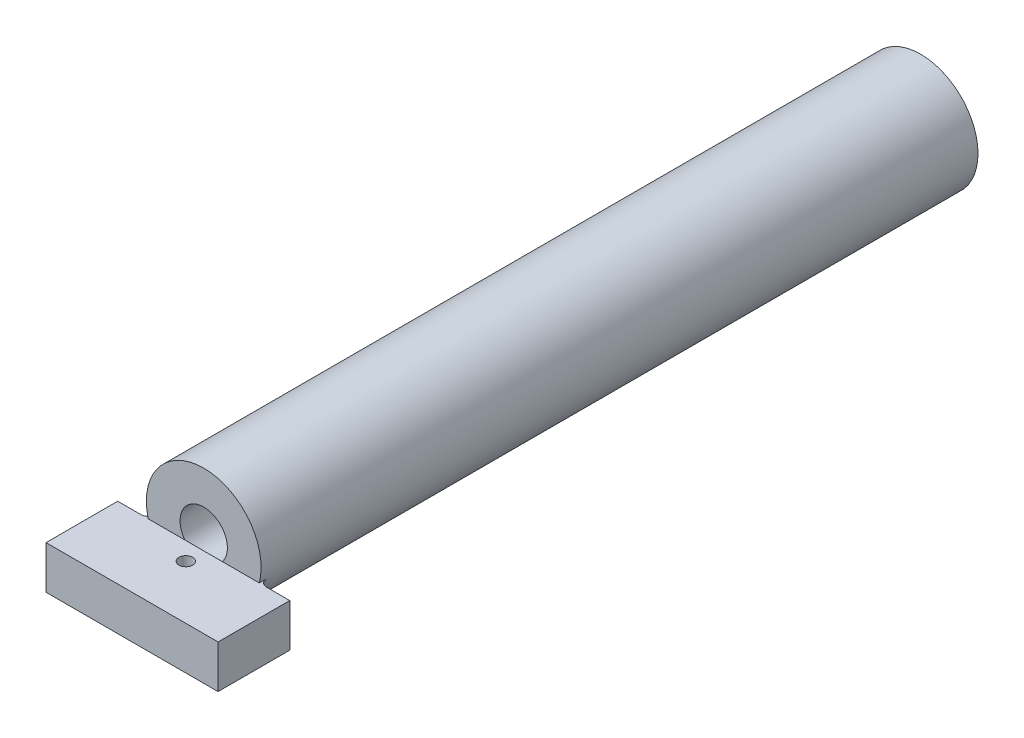
ISO-10303-21;
HEADER;
FILE_DESCRIPTION(('STEP AP214'),'2;1');
FILE_NAME('part.step','',(''),(''),'','','');
FILE_SCHEMA(('AUTOMOTIVE_DESIGN { 1 0 10303 214 1 1 1 1 }'));
ENDSEC;
DATA;
#1=APPLICATION_CONTEXT('core data for automotive mechanical design processes');
#2=APPLICATION_PROTOCOL_DEFINITION('international standard','automotive_design',2000,#1);
#3=PRODUCT_CONTEXT('',#1,'mechanical');
#4=PRODUCT('Part','Part','',(#3));
#5=PRODUCT_RELATED_PRODUCT_CATEGORY('part','',(#4));
#6=PRODUCT_DEFINITION_FORMATION('','',#4);
#7=PRODUCT_DEFINITION_CONTEXT('part definition',#1,'design');
#8=PRODUCT_DEFINITION('design','',#6,#7);
#9=PRODUCT_DEFINITION_SHAPE('','',#8);
#10=(LENGTH_UNIT() NAMED_UNIT(*) SI_UNIT(.MILLI.,.METRE.));
#11=(NAMED_UNIT(*) PLANE_ANGLE_UNIT() SI_UNIT($,.RADIAN.));
#12=(NAMED_UNIT(*) SI_UNIT($,.STERADIAN.) SOLID_ANGLE_UNIT());
#13=UNCERTAINTY_MEASURE_WITH_UNIT(LENGTH_MEASURE(1.E-05),#10,'distance_accuracy_value','');
#14=(GEOMETRIC_REPRESENTATION_CONTEXT(3) GLOBAL_UNCERTAINTY_ASSIGNED_CONTEXT((#13)) GLOBAL_UNIT_ASSIGNED_CONTEXT((#10,
#11,#12)) REPRESENTATION_CONTEXT('',''));
#15=CARTESIAN_POINT('',(0.,0.,0.));
#16=DIRECTION('',(0.,0.,1.));
#17=DIRECTION('',(1.,0.,0.));
#18=AXIS2_PLACEMENT_3D('',#15,#16,#17);
#19=CARTESIAN_POINT('',(-6.,-1.,55.));
#20=DIRECTION('',(0.,-1.,0.));
#21=DIRECTION('',(1.,0.,0.));
#22=AXIS2_PLACEMENT_3D('',#19,#20,#21);
#23=PLANE('',#22);
#24=DIRECTION('',(-1.,0.,0.));
#25=VECTOR('',#24,1.);
#26=CARTESIAN_POINT('',(-6.,-1.,50.));
#27=LINE('',#26,#25);
#28=CARTESIAN_POINT('',(6.,-0.999999999999997,50.));
#29=VERTEX_POINT('',#28);
#30=CARTESIAN_POINT('',(4.38748219369606,-0.999999999999998,50.));
#31=VERTEX_POINT('',#30);
#32=EDGE_CURVE('E162',#29,#31,#27,.T.);
#33=ORIENTED_EDGE('',*,*,#32,.T.);
#34=CARTESIAN_POINT('',(4.38748219369606,-0.999999999999998,50.));
#35=CARTESIAN_POINT('',(4.3579655596069,-0.999999999999998,50.0000208387773));
#36=CARTESIAN_POINT('',(4.32845429997108,-0.999999999999998,49.9975165101157));
#37=CARTESIAN_POINT('',(4.27026566312128,-0.999999999999998,49.9876239291536));
#38=CARTESIAN_POINT('',(4.24158816656995,-0.999999999999998,49.9802363794221));
#39=CARTESIAN_POINT('',(4.18586439432141,-0.999999999999998,49.9607377881979));
#40=CARTESIAN_POINT('',(4.15881911487868,-0.999999999999998,49.948623894897));
#41=CARTESIAN_POINT('',(4.10717852525789,-0.999999999999998,49.9199906414731));
#42=CARTESIAN_POINT('',(4.0825824373352,-0.999999999999998,49.9034726860338));
#43=CARTESIAN_POINT('',(4.03680615359169,-0.999999999999998,49.8666344160125));
#44=CARTESIAN_POINT('',(4.01559576179776,-0.999999999999998,49.846351665449));
#45=CARTESIAN_POINT('',(3.97698904486767,-0.999999999999998,49.8024209202437));
#46=CARTESIAN_POINT('',(3.95959314486626,-0.999999999999998,49.778772550979));
#47=CARTESIAN_POINT('',(3.92961870799203,-0.999999999999998,49.7294523983464));
#48=CARTESIAN_POINT('',(3.91692533752926,-0.999999999999998,49.7038503301077));
#49=CARTESIAN_POINT('',(3.8961734608679,-0.999999999999998,49.6508444296601));
#50=CARTESIAN_POINT('',(3.88811009706772,-0.999999999999998,49.6234425195385));
#51=CARTESIAN_POINT('',(3.87933882799489,-0.999999999999998,49.5798367998571));
#52=CARTESIAN_POINT('',(3.87695695138903,-0.999999999999998,49.563952081624));
#53=CARTESIAN_POINT('',(3.87377975340196,-0.999999999999998,49.5320475816672));
#54=CARTESIAN_POINT('',(3.87298218705146,-0.999999999999998,49.516028023406));
#55=CARTESIAN_POINT('',(3.87298334620716,-0.999999999999998,49.5));
#56=B_SPLINE_CURVE_WITH_KNOTS('',3,(#34,#35,#36,#37,#38,#39,#40,#41,#42,#43,#44,#45,#46,#47,#48,
#49,#50,#51,#52,#53,#54,#55),.UNSPECIFIED.,.F.,.F.,(4,2,2,2,2,2,2,2,2,2,4),(0.,
0.0884369833283033,0.176861245635041,0.265338944597825,0.353788457122878,0.441398755231839,
0.529018812772268,0.614330656023137,0.699552829485026,0.747668746267924,0.795716433971873),.UNSPECIFIED.);
#57=CARTESIAN_POINT('',(3.87298334620742,-0.999999999999998,49.5));
#58=VERTEX_POINT('',#57);
#59=EDGE_CURVE('E11',#31,#58,#56,.T.);
#60=ORIENTED_EDGE('',*,*,#59,.T.);
#61=DIRECTION('',(0.,0.,-1.));
#62=VECTOR('',#61,1.);
#63=CARTESIAN_POINT('',(3.87298334620742,-0.999999999999998,50.));
#64=LINE('',#63,#62);
#65=CARTESIAN_POINT('',(3.87298334620742,-0.999999999999998,50.));
#66=VERTEX_POINT('',#65);
#67=EDGE_CURVE('E64',#66,#58,#64,.T.);
#68=ORIENTED_EDGE('',*,*,#67,.F.);
#69=CARTESIAN_POINT('',(1.31244047484066,-0.999999999999998,50.));
#70=VERTEX_POINT('',#69);
#71=EDGE_CURVE('E149',#66,#70,#27,.T.);
#72=ORIENTED_EDGE('',*,*,#71,.T.);
#73=CARTESIAN_POINT('',(-1.31244047484065,-0.999999999999999,50.));
#74=VERTEX_POINT('',#73);
#75=EDGE_CURVE('E135',#70,#74,#27,.T.);
#76=ORIENTED_EDGE('',*,*,#75,.T.);
#77=CARTESIAN_POINT('',(-3.87298334620742,-0.999999999999999,50.));
#78=VERTEX_POINT('',#77);
#79=EDGE_CURVE('E153',#74,#78,#27,.T.);
#80=ORIENTED_EDGE('',*,*,#79,.T.);
#81=DIRECTION('',(0.,0.,-1.));
#82=VECTOR('',#81,1.);
#83=CARTESIAN_POINT('',(-3.87298334620742,-0.999999999999999,49.5));
#84=LINE('',#83,#82);
#85=CARTESIAN_POINT('',(-3.87298334620742,-0.999999999999999,49.5));
#86=VERTEX_POINT('',#85);
#87=EDGE_CURVE('E471',#86,#78,#84,.F.);
#88=ORIENTED_EDGE('',*,*,#87,.F.);
#89=CARTESIAN_POINT('',(-3.87298334620742,-0.999999999999999,49.5));
#90=CARTESIAN_POINT('',(-3.87295537499168,-0.999999999999999,49.5275081549908));
#91=CARTESIAN_POINT('',(-3.87532608755468,-0.999999999999999,49.5550032904264));
#92=CARTESIAN_POINT('',(-3.88465117883786,-0.999999999999999,49.6091578178667));
#93=CARTESIAN_POINT('',(-3.89159759115641,-0.999999999999999,49.6358185781844));
#94=CARTESIAN_POINT('',(-3.90986295023486,-0.999999999999999,49.6875989492315));
#95=CARTESIAN_POINT('',(-3.92118248427702,-0.999999999999999,49.7127183524413));
#96=CARTESIAN_POINT('',(-3.94781636561318,-0.999999999999999,49.760739703841));
#97=CARTESIAN_POINT('',(-3.96313112050617,-0.999999999999999,49.7836414254524));
#98=CARTESIAN_POINT('',(-3.99753718784904,-0.999999999999999,49.8269569092179));
#99=CARTESIAN_POINT('',(-4.01668060081805,-0.999999999999999,49.8473292497739));
#100=CARTESIAN_POINT('',(-4.0580313606789,-0.999999999999999,49.8846864484069));
#101=CARTESIAN_POINT('',(-4.08023948892935,-0.999999999999999,49.9016704399046));
#102=CARTESIAN_POINT('',(-4.12778792097366,-0.999999999999999,49.9322919662112));
#103=CARTESIAN_POINT('',(-4.15320134973191,-0.999999999999999,49.94581587508));
#104=CARTESIAN_POINT('',(-4.20589821050653,-0.999999999999999,49.9685142203754));
#105=CARTESIAN_POINT('',(-4.23318116953688,-0.999999999999999,49.977689752313));
#106=CARTESIAN_POINT('',(-4.28169618700588,-0.999999999999999,49.9897002278973));
#107=CARTESIAN_POINT('',(-4.30268121423568,-0.999999999999999,49.9935586884998));
#108=CARTESIAN_POINT('',(-4.34493580779306,-0.999999999999999,49.9987087678551));
#109=CARTESIAN_POINT('',(-4.36620496406441,-0.999999999999999,50.0000037523184));
#110=CARTESIAN_POINT('',(-4.38748219369606,-0.999999999999999,50.));
#111=B_SPLINE_CURVE_WITH_KNOTS('',3,(#89,#90,#91,#92,#93,#94,#95,#96,#97,#98,#99,#100,#101,#102,
#103,#104,#105,#106,#107,#108,#109,#110),.UNSPECIFIED.,.F.,.F.,(4,2,2,2,2,2,2,2,2,2,4),(0.,
0.0824027388343111,0.164662390397504,0.246933092747435,0.329212191773906,0.412698184013623,
0.49620550072391,0.582178686329188,0.668130200694452,0.731991092430384,0.795768082386863),.UNSPECIFIED.);
#112=CARTESIAN_POINT('',(-4.38748219369606,-0.999999999999999,50.));
#113=VERTEX_POINT('',#112);
#114=EDGE_CURVE('E57',#86,#113,#111,.T.);
#115=ORIENTED_EDGE('',*,*,#114,.T.);
#116=CARTESIAN_POINT('',(-6.,-1.,50.));
#117=VERTEX_POINT('',#116);
#118=EDGE_CURVE('E158',#113,#117,#27,.T.);
#119=ORIENTED_EDGE('',*,*,#118,.T.);
#120=DIRECTION('',(0.,0.,-1.));
#121=VECTOR('',#120,1.);
#122=CARTESIAN_POINT('',(-6.,-1.,55.));
#123=LINE('',#122,#121);
#124=CARTESIAN_POINT('',(-6.,-1.,55.));
#125=VERTEX_POINT('',#124);
#126=EDGE_CURVE('E169',#125,#117,#123,.T.);
#127=ORIENTED_EDGE('',*,*,#126,.F.);
#128=DIRECTION('',(-1.,0.,0.));
#129=VECTOR('',#128,1.);
#130=CARTESIAN_POINT('',(-6.,-1.,55.));
#131=LINE('',#130,#129);
#132=CARTESIAN_POINT('',(6.,-0.999999999999997,55.));
#133=VERTEX_POINT('',#132);
#134=EDGE_CURVE('E174',#133,#125,#131,.T.);
#135=ORIENTED_EDGE('',*,*,#134,.F.);
#136=DIRECTION('',(0.,0.,-1.));
#137=VECTOR('',#136,1.);
#138=CARTESIAN_POINT('',(6.,-0.999999999999997,55.));
#139=LINE('',#138,#137);
#140=EDGE_CURVE('E173',#133,#29,#139,.T.);
#141=ORIENTED_EDGE('',*,*,#140,.T.);
#142=EDGE_LOOP('',(#33,#60,#68,#72,#76,#80,#88,#115,#119,#127,#135,#141));
#143=FACE_BOUND('',#142,.T.);
#144=CARTESIAN_POINT('',(0.,-0.999999999999999,51.25));
#145=DIRECTION('',(0.,1.,0.));
#146=DIRECTION('',(0.,0.,1.));
#147=AXIS2_PLACEMENT_3D('',#144,#145,#146);
#148=CIRCLE('',#147,0.475);
#149=CARTESIAN_POINT('',(0.,-0.999999999999999,51.725));
#150=VERTEX_POINT('',#149);
#151=EDGE_CURVE('E326',#150,#150,#148,.T.);
#152=ORIENTED_EDGE('',*,*,#151,.F.);
#153=EDGE_LOOP('',(#152));
#154=FACE_BOUND('',#153,.T.);
#155=ADVANCED_FACE('F41',(#143,#154),#23,.F.);
#156=CARTESIAN_POINT('',(0.,0.,50.));
#157=DIRECTION('',(0.,0.,-1.));
#158=DIRECTION('',(-1.,0.,0.));
#159=AXIS2_PLACEMENT_3D('',#156,#157,#158);
#160=CYLINDRICAL_SURFACE('',#159,4.);
#161=CARTESIAN_POINT('',(0.,0.,49.5));
#162=DIRECTION('',(0.,0.,1.));
#163=DIRECTION('',(1.,0.,0.));
#164=AXIS2_PLACEMENT_3D('',#161,#162,#163);
#165=CIRCLE('',#164,4.);
#166=CARTESIAN_POINT('',(-1.83249138916341,-3.55555555555556,49.5));
#167=VERTEX_POINT('',#166);
#168=EDGE_CURVE('E323',#167,#86,#165,.F.);
#169=ORIENTED_EDGE('',*,*,#168,.T.);
#170=ORIENTED_EDGE('',*,*,#87,.T.);
#171=CARTESIAN_POINT('',(0.,0.,50.));
#172=DIRECTION('',(0.,0.,1.));
#173=DIRECTION('',(1.,0.,0.));
#174=AXIS2_PLACEMENT_3D('',#171,#172,#173);
#175=CIRCLE('',#174,4.);
#176=EDGE_CURVE('E155',#66,#78,#175,.T.);
#177=ORIENTED_EDGE('',*,*,#176,.F.);
#178=ORIENTED_EDGE('',*,*,#67,.T.);
#179=CARTESIAN_POINT('',(0.,0.,49.5));
#180=DIRECTION('',(0.,0.,1.));
#181=DIRECTION('',(1.,0.,0.));
#182=AXIS2_PLACEMENT_3D('',#179,#180,#181);
#183=CIRCLE('',#182,4.);
#184=CARTESIAN_POINT('',(1.83249138916341,-3.55555555555555,49.5));
#185=VERTEX_POINT('',#184);
#186=EDGE_CURVE('E204',#58,#185,#183,.F.);
#187=ORIENTED_EDGE('',*,*,#186,.T.);
#188=CARTESIAN_POINT('',(2.16952896195804,-3.36052735195315,49.5507109090503));
#189=CARTESIAN_POINT('',(2.01117084205837,-3.46276205844465,50.262355845833));
#190=CARTESIAN_POINT('',(2.4407200822028,-4.,50.));
#191=CARTESIAN_POINT('',(2.13944840148043,-3.37995314147845,49.5400749812985));
#192=CARTESIAN_POINT('',(2.00690286258443,-3.46358692840004,50.2303387219114));
#193=CARTESIAN_POINT('',(2.40687945170415,-4.,50.));
#194=CARTESIAN_POINT('',(2.10876059091074,-3.39918647206907,49.5314391632247));
#195=CARTESIAN_POINT('',(1.99763975260752,-3.46792398150366,50.1996341082853));
#196=CARTESIAN_POINT('',(2.37235566481839,-4.,50.));
#197=CARTESIAN_POINT('',(2.04649787804406,-3.43702791226454,49.5175829425984));
#198=CARTESIAN_POINT('',(1.97166696349641,-3.48137300789502,50.1432886286419));
#199=CARTESIAN_POINT('',(2.30231011282917,-4.,50.));
#200=CARTESIAN_POINT('',(2.01492522018907,-3.45563737989088,49.5123545932519));
#201=CARTESIAN_POINT('',(1.95527400966877,-3.49027734945748,50.1173275681652));
#202=CARTESIAN_POINT('',(2.26679087272303,-4.,50.));
#203=CARTESIAN_POINT('',(1.91977048217065,-3.50995412679254,49.5009234217695));
#204=CARTESIAN_POINT('',(1.8998418865749,-3.52023266023793,50.048706197833));
#205=CARTESIAN_POINT('',(2.15974179242153,-4.,50.));
#206=CARTESIAN_POINT('',(1.85516114492516,-3.5445320187608,49.4987930040395));
#207=CARTESIAN_POINT('',(1.85296723663071,-3.54540456631872,50.0104158636961));
#208=CARTESIAN_POINT('',(2.08705628803503,-4.,50.));
#209=CARTESIAN_POINT('',(1.72854569478539,-3.60788469893158,49.5022842310967));
#210=CARTESIAN_POINT('',(1.75172738071678,-3.59648449890083,49.9515485317245));
#211=CARTESIAN_POINT('',(1.94461390663897,-4.,50.));
#212=CARTESIAN_POINT('',(1.66663618229528,-3.63688890322888,49.5074203671711));
#213=CARTESIAN_POINT('',(1.69835623757413,-3.62223417984358,49.9290606863778));
#214=CARTESIAN_POINT('',(1.87496570508521,-4.,50.));
#215=CARTESIAN_POINT('',(1.54184138190905,-3.69152645901266,49.52292209188));
#216=CARTESIAN_POINT('',(1.58616025524661,-3.67285481301091,49.8943436397007));
#217=CARTESIAN_POINT('',(1.73457155464806,-4.,50.));
#218=CARTESIAN_POINT('',(1.47895561200563,-3.7171580820894,49.5332903488583));
#219=CARTESIAN_POINT('',(1.52719302990569,-3.69793973131403,49.8815347526966));
#220=CARTESIAN_POINT('',(1.66382506350647,-4.,50.));
#221=CARTESIAN_POINT('',(1.2883958170541,-3.78926959249193,49.5705342588108));
#222=CARTESIAN_POINT('',(1.34787720457326,-3.76859453935796,49.8550801967132));
#223=CARTESIAN_POINT('',(1.4494452941856,-4.,50.));
#224=CARTESIAN_POINT('',(1.15968237085697,-3.8305367896599,49.6034880290286));
#225=CARTESIAN_POINT('',(1.21753999129995,-3.81321575785025,49.8508084206431));
#226=CARTESIAN_POINT('',(1.30464266721401,-4.,50.));
#227=CARTESIAN_POINT('',(0.861579460450289,-3.91001818296898,49.6902320292542));
#228=CARTESIAN_POINT('',(0.915029461070747,-3.89811073527175,49.8616476478934));
#229=CARTESIAN_POINT('',(0.969276893006679,-4.,50.));
#230=CARTESIAN_POINT('',(0.691732606635709,-3.94348083525715,49.7473113587953));
#231=CARTESIAN_POINT('',(0.734725545194645,-3.93642694787496,49.881762407255));
#232=CARTESIAN_POINT('',(0.778199182465199,-4.,50.));
#233=CARTESIAN_POINT('',(0.35163930764108,-3.98818831508049,49.8681952216582));
#234=CARTESIAN_POINT('',(0.376121529396611,-3.98632694531751,49.9337519347226));
#235=CARTESIAN_POINT('',(0.395594221096189,-4.,50.));
#236=CARTESIAN_POINT('',(0.181395837954312,-3.99950326687966,49.9319778528307));
#237=CARTESIAN_POINT('',(0.192787116895043,-3.99943468286611,49.9659814670081));
#238=CARTESIAN_POINT('',(0.2040703176986,-4.,50.));
#239=CARTESIAN_POINT('',(0.00754239675375611,-3.99999465949081,49.9971716072612));
#240=CARTESIAN_POINT('',(0.00801381325567979,-3.99999413220048,49.9985857954653));
#241=CARTESIAN_POINT('',(0.00848519634797552,-4.,50.));
#242=CARTESIAN_POINT('',(0.00377115528744063,-3.99999999222896,49.9985858231414));
#243=CARTESIAN_POINT('',(0.00400684184907775,-4.00000013810187,49.999292907972));
#244=CARTESIAN_POINT('',(0.00424254969837061,-4.,50.));
#245=CARTESIAN_POINT('',(0.,-4.,50.));
#246=CARTESIAN_POINT('',(0.,-4.,50.));
#247=CARTESIAN_POINT('',(0.,-4.,50.));
#248=(BOUNDED_SURFACE() B_SPLINE_SURFACE(3,2,((#188,#189,#190),(#191,#192,#193),(#194,#195,
#196),(#197,#198,#199),(#200,#201,#202),(#203,#204,#205),(#206,#207,#208),(#209,#210,#211),
(#212,#213,#214),(#215,#216,#217),(#218,#219,#220),(#221,#222,#223),(#224,#225,#226),(#227,#228,
#229),(#230,#231,#232),(#233,#234,#235),(#236,#237,#238),(#239,#240,#241),(#242,#243,#244),
(#245,#246,#247)),.UNSPECIFIED.,.F.,.F.,.F.) B_SPLINE_SURFACE_WITH_KNOTS((4,2,2,2,2,2,2,2,2,4),
(3,3),(0.,0.124834247115442,0.249376307827587,0.496051228968442,0.727001518257811,
0.958069709746878,1.42342989745156,2.03041960029169,2.63548431765479,2.64890073759473),(0.,1.),
.UNSPECIFIED.) GEOMETRIC_REPRESENTATION_ITEM() RATIONAL_B_SPLINE_SURFACE(((1.,0.5618446595403,
1.),(1.,0.577230213575031,1.),(1.,0.592126073438027,1.),(1.,0.620911477772448,1.),(1.,
0.634803296015309,1.),(1.,0.674777385747545,1.),(1.,0.699454735684473,1.),(1.,0.74383741442871,
1.),(1.,0.763759412670923,1.),(1.,0.800813834436687,1.),(1.,0.817944828665197,1.),(1.,
0.865707758811895,1.),(1.,0.892416654770257,1.),(1.,0.943429397606291,1.),(1.,0.964527366158078,
1.),(1.,0.992635402455306,1.),(1.,0.999689935872588,1.),(1.,0.999996653429461,1.),(1.,
0.999999985970192,1.),(1.,1.,1.))) REPRESENTATION_ITEM('') SURFACE());
#249=CARTESIAN_POINT('',(2.16952896195804,-3.36052735195315,49.5507109090503));
#250=CARTESIAN_POINT('',(2.13944840148043,-3.37995314147845,49.5400749812984));
#251=CARTESIAN_POINT('',(2.10876059091074,-3.39918647206907,49.5314391632247));
#252=CARTESIAN_POINT('',(2.04649787804406,-3.43702791226454,49.5175829425984));
#253=CARTESIAN_POINT('',(2.01492522018907,-3.45563737989088,49.5123545932519));
#254=CARTESIAN_POINT('',(1.91977048217065,-3.50995412679254,49.5009234217695));
#255=CARTESIAN_POINT('',(1.85516114492516,-3.5445320187608,49.4987930040395));
#256=CARTESIAN_POINT('',(1.72854569478539,-3.60788469893158,49.5022842310967));
#257=CARTESIAN_POINT('',(1.66663618229528,-3.63688890322888,49.5074203671711));
#258=CARTESIAN_POINT('',(1.54184138190905,-3.69152645901266,49.52292209188));
#259=CARTESIAN_POINT('',(1.47895561200563,-3.7171580820894,49.5332903488583));
#260=CARTESIAN_POINT('',(1.2883958170541,-3.78926959249193,49.5705342588108));
#261=CARTESIAN_POINT('',(1.15968237085697,-3.8305367896599,49.6034880290286));
#262=CARTESIAN_POINT('',(0.861579460450289,-3.91001818296898,49.6902320292542));
#263=CARTESIAN_POINT('',(0.691732606635709,-3.94348083525716,49.7473113587953));
#264=CARTESIAN_POINT('',(0.35163930764108,-3.98818831508049,49.8681952216582));
#265=CARTESIAN_POINT('',(0.181395837954312,-3.99950326687966,49.9319778528306));
#266=CARTESIAN_POINT('',(0.00754239675375611,-3.99999465949081,49.9971716072612));
#267=CARTESIAN_POINT('',(0.00377115528744064,-3.99999999222896,49.9985858231414));
#268=CARTESIAN_POINT('',(0.,-4.,50.));
#269=B_SPLINE_CURVE_WITH_KNOTS('',3,(#249,#250,#251,#252,#253,#254,#255,#256,#257,#258,#259,
#260,#261,#262,#263,#264,#265,#266,#267,#268),.UNSPECIFIED.,.F.,.F.,(4,2,2,2,2,2,2,2,2,4),(0.,
0.124834247115442,0.249376307827587,0.496051228968442,0.727001518257811,0.958069709746878,
1.42342989745156,2.03041960029169,2.63548431765479,2.64890073759473),.UNSPECIFIED.);
#270=CARTESIAN_POINT('',(0.,-4.,50.));
#271=VERTEX_POINT('',#270);
#272=EDGE_CURVE('E195',#185,#271,#269,.T.);
#273=ORIENTED_EDGE('',*,*,#272,.T.);
#274=CARTESIAN_POINT('',(-2.4407200822011,-4.,50.));
#275=CARTESIAN_POINT('',(-2.01117084205815,-3.46276205844469,50.2623558458314));
#276=CARTESIAN_POINT('',(-2.16952896195654,-3.36052735195412,49.5507109090498));
#277=CARTESIAN_POINT('',(-2.40687945170232,-4.,50.));
#278=CARTESIAN_POINT('',(-2.00690286258403,-3.4635869284002,50.2303387219097));
#279=CARTESIAN_POINT('',(-2.1394484014788,-3.37995314147948,49.5400749812979));
#280=CARTESIAN_POINT('',(-2.37235566481641,-4.,50.));
#281=CARTESIAN_POINT('',(-1.99763975260693,-3.46792398150395,50.1996341082836));
#282=CARTESIAN_POINT('',(-2.10876059090898,-3.39918647207016,49.5314391632243));
#283=CARTESIAN_POINT('',(-2.3023101128269,-4.,50.));
#284=CARTESIAN_POINT('',(-1.97166696349544,-3.48137300789554,50.1432886286402));
#285=CARTESIAN_POINT('',(-2.04649787804204,-3.43702791226574,49.517582942598));
#286=CARTESIAN_POINT('',(-2.26679087272062,-4.,50.));
#287=CARTESIAN_POINT('',(-1.95527400966761,-3.49027734945811,50.1173275681635));
#288=CARTESIAN_POINT('',(-2.01492522018693,-3.45563737989213,49.5123545932516));
#289=CARTESIAN_POINT('',(-2.15974179241868,-4.,50.));
#290=CARTESIAN_POINT('',(-1.8998418865732,-3.52023266023885,50.0487061978314));
#291=CARTESIAN_POINT('',(-1.91977048216812,-3.50995412679393,49.5009234217693));
#292=CARTESIAN_POINT('',(-2.0870562880319,-4.,50.));
#293=CARTESIAN_POINT('',(-1.85296723662865,-3.54540456631981,50.0104158636945));
#294=CARTESIAN_POINT('',(-1.85516114492237,-3.54453201876226,49.4987930040394));
#295=CARTESIAN_POINT('',(-1.94461390663527,-4.,50.));
#296=CARTESIAN_POINT('',(-1.75172738071403,-3.59648449890218,49.9515485317232));
#297=CARTESIAN_POINT('',(-1.7285456947821,-3.60788469893316,49.5022842310969));
#298=CARTESIAN_POINT('',(-1.87496570508124,-4.,50.));
#299=CARTESIAN_POINT('',(-1.69835623757107,-3.62223417984503,49.9290606863767));
#300=CARTESIAN_POINT('',(-1.66663618229175,-3.6368889032305,49.5074203671714));
#301=CARTESIAN_POINT('',(-1.73457155464355,-4.,50.));
#302=CARTESIAN_POINT('',(-1.58616025524292,-3.67285481301252,49.8943436396998));
#303=CARTESIAN_POINT('',(-1.54184138190504,-3.69152645901433,49.5229220918806));
#304=CARTESIAN_POINT('',(-1.66382506350169,-4.,50.));
#305=CARTESIAN_POINT('',(-1.5271930299017,-3.6979397313157,49.8815347526958));
#306=CARTESIAN_POINT('',(-1.47895561200138,-3.71715808209109,49.5332903488591));
#307=CARTESIAN_POINT('',(-1.44944529418001,-4.,50.));
#308=CARTESIAN_POINT('',(-1.34787720456837,-3.76859453935973,49.8550801967129));
#309=CARTESIAN_POINT('',(-1.28839581704914,-3.78926959249363,49.570534258812));
#310=CARTESIAN_POINT('',(-1.30464266720788,-4.,50.));
#311=CARTESIAN_POINT('',(-1.21753999129447,-3.81321575785202,49.8508084206431));
#312=CARTESIAN_POINT('',(-1.15968237085152,-3.83053678966157,49.6034880290301));
#313=CARTESIAN_POINT('',(-0.969276893001096,-4.,50.));
#314=CARTESIAN_POINT('',(-0.915029461065477,-3.89811073527294,49.8616476478939));
#315=CARTESIAN_POINT('',(-0.861579460445326,-3.91001818297003,49.6902320292559));
#316=CARTESIAN_POINT('',(-0.778199182460719,-4.,50.));
#317=CARTESIAN_POINT('',(-0.734725545190417,-3.9364269478757,49.8817624072555));
#318=CARTESIAN_POINT('',(-0.691732606631727,-3.94348083525781,49.7473113587966));
#319=CARTESIAN_POINT('',(-0.395594221093959,-4.,50.));
#320=CARTESIAN_POINT('',(-0.376121529394462,-3.98632694531767,49.9337519347229));
#321=CARTESIAN_POINT('',(-0.351639307639098,-3.98818831508063,49.868195221659));
#322=CARTESIAN_POINT('',(-0.204070317697517,-4.,50.));
#323=CARTESIAN_POINT('',(-0.19278711689402,-3.99943468286612,49.9659814670083));
#324=CARTESIAN_POINT('',(-0.181395837953349,-3.99950326687967,49.9319778528312));
#325=CARTESIAN_POINT('',(-0.00848519634797427,-4.,50.));
#326=CARTESIAN_POINT('',(-0.00801381325567851,-3.99999413220048,49.9985857954653));
#327=CARTESIAN_POINT('',(-0.0075423967537548,-3.99999465949081,49.9971716072612));
#328=CARTESIAN_POINT('',(-0.00424254969836914,-4.,50.));
#329=CARTESIAN_POINT('',(-0.00400684184907626,-4.00000013810187,49.999292907972));
#330=CARTESIAN_POINT('',(-0.00377115528743912,-3.99999999222896,49.9985858231414));
#331=CARTESIAN_POINT('',(0.,-4.,50.));
#332=CARTESIAN_POINT('',(0.,-4.,50.));
#333=CARTESIAN_POINT('',(0.,-4.,50.));
#334=(BOUNDED_SURFACE() B_SPLINE_SURFACE(3,2,((#274,#275,#276),(#277,#278,#279),(#280,#281,
#282),(#283,#284,#285),(#286,#287,#288),(#289,#290,#291),(#292,#293,#294),(#295,#296,#297),
(#298,#299,#300),(#301,#302,#303),(#304,#305,#306),(#307,#308,#309),(#310,#311,#312),(#313,#314,
#315),(#316,#317,#318),(#319,#320,#321),(#322,#323,#324),(#325,#326,#327),(#328,#329,#330),
(#331,#332,#333)),.UNSPECIFIED.,.F.,.F.,.F.) B_SPLINE_SURFACE_WITH_KNOTS((4,2,2,2,2,2,2,2,2,4),
(3,3),(0.,0.124834247115876,0.249376307828455,0.496051228970182,0.727001518260373,
0.958069709750262,1.42342989745658,2.03041960029315,2.63548431765272,2.64890073759266),(0.,1.),
.UNSPECIFIED.) GEOMETRIC_REPRESENTATION_ITEM() RATIONAL_B_SPLINE_SURFACE(((1.,0.561844659541069,
1.),(1.,0.577230213575837,1.),(1.,0.592126073438867,1.),(1.,0.62091147777335,1.),(1.,
0.634803296016237,1.),(1.,0.674777385748546,1.),(1.,0.699454735685511,1.),(1.,0.7438374144298,
1.),(1.,0.763759412672031,1.),(1.,0.800813834437815,1.),(1.,0.817944828666327,1.),(1.,
0.86570775881301,1.),(1.,0.892416654771333,1.),(1.,0.94342939760695,1.),(1.,0.964527366158488,
1.),(1.,0.992635402455388,1.),(1.,0.99968993587259,1.),(1.,0.999996653429461,1.),(1.,
0.999999985970192,1.),(1.,1.,1.))) REPRESENTATION_ITEM('') SURFACE());
#335=CARTESIAN_POINT('',(-2.16952896195654,-3.36052735195412,49.5507109090498));
#336=CARTESIAN_POINT('',(-2.1394484014788,-3.37995314147948,49.5400749812979));
#337=CARTESIAN_POINT('',(-2.10876059090899,-3.39918647207016,49.5314391632243));
#338=CARTESIAN_POINT('',(-2.04649787804204,-3.43702791226574,49.517582942598));
#339=CARTESIAN_POINT('',(-2.01492522018693,-3.45563737989213,49.5123545932516));
#340=CARTESIAN_POINT('',(-1.91977048216812,-3.50995412679393,49.5009234217693));
#341=CARTESIAN_POINT('',(-1.85516114492237,-3.54453201876226,49.4987930040394));
#342=CARTESIAN_POINT('',(-1.7285456947821,-3.60788469893316,49.5022842310969));
#343=CARTESIAN_POINT('',(-1.66663618229175,-3.6368889032305,49.5074203671714));
#344=CARTESIAN_POINT('',(-1.54184138190504,-3.69152645901433,49.5229220918806));
#345=CARTESIAN_POINT('',(-1.47895561200138,-3.71715808209109,49.5332903488591));
#346=CARTESIAN_POINT('',(-1.28839581704914,-3.78926959249363,49.570534258812));
#347=CARTESIAN_POINT('',(-1.15968237085152,-3.83053678966156,49.6034880290301));
#348=CARTESIAN_POINT('',(-0.861579460445326,-3.91001818297003,49.6902320292559));
#349=CARTESIAN_POINT('',(-0.691732606631727,-3.94348083525781,49.7473113587966));
#350=CARTESIAN_POINT('',(-0.351639307639098,-3.98818831508062,49.868195221659));
#351=CARTESIAN_POINT('',(-0.181395837953349,-3.99950326687966,49.9319778528311));
#352=CARTESIAN_POINT('',(-0.0075423967537548,-3.99999465949081,49.9971716072612));
#353=CARTESIAN_POINT('',(-0.00377115528743912,-3.99999999222896,49.9985858231414));
#354=CARTESIAN_POINT('',(0.,-4.,50.));
#355=B_SPLINE_CURVE_WITH_KNOTS('',3,(#335,#336,#337,#338,#339,#340,#341,#342,#343,#344,#345,
#346,#347,#348,#349,#350,#351,#352,#353,#354),.UNSPECIFIED.,.F.,.F.,(4,2,2,2,2,2,2,2,2,4),(0.,
0.124834247115876,0.249376307828455,0.496051228970182,0.727001518260373,0.958069709750262,
1.42342989745658,2.03041960029315,2.63548431765272,2.64890073759266),.UNSPECIFIED.);
#356=EDGE_CURVE('E329',#271,#167,#355,.F.);
#357=ORIENTED_EDGE('',*,*,#356,.T.);
#358=EDGE_LOOP('',(#169,#170,#177,#178,#187,#273,#357));
#359=FACE_BOUND('',#358,.T.);
#360=CARTESIAN_POINT('',(0.,0.,0.));
#361=DIRECTION('',(0.,0.,1.));
#362=DIRECTION('',(1.,0.,0.));
#363=AXIS2_PLACEMENT_3D('',#360,#361,#362);
#364=CIRCLE('',#363,4.);
#365=CARTESIAN_POINT('',(4.,0.,0.));
#366=VERTEX_POINT('',#365);
#367=EDGE_CURVE('E186',#366,#366,#364,.T.);
#368=ORIENTED_EDGE('',*,*,#367,.T.);
#369=EDGE_LOOP('',(#368));
#370=FACE_BOUND('',#369,.T.);
#371=ADVANCED_FACE('F206',(#359,#370),#160,.T.);
#372=CARTESIAN_POINT('',(0.,0.,50.));
#373=DIRECTION('',(0.,0.,1.));
#374=DIRECTION('',(1.,0.,0.));
#375=AXIS2_PLACEMENT_3D('',#372,#373,#374);
#376=PLANE('',#375);
#377=CARTESIAN_POINT('',(0.,0.,50.));
#378=DIRECTION('',(0.,0.,1.));
#379=DIRECTION('',(1.,0.,0.));
#380=AXIS2_PLACEMENT_3D('',#377,#378,#379);
#381=CIRCLE('',#380,1.64999999999999);
#382=EDGE_CURVE('E142',#70,#74,#381,.T.);
#383=ORIENTED_EDGE('',*,*,#382,.F.);
#384=ORIENTED_EDGE('',*,*,#71,.F.);
#385=ORIENTED_EDGE('',*,*,#176,.T.);
#386=ORIENTED_EDGE('',*,*,#79,.F.);
#387=EDGE_LOOP('',(#383,#384,#385,#386));
#388=FACE_BOUND('',#387,.T.);
#389=ADVANCED_FACE('F154',(#388),#376,.T.);
#390=CARTESIAN_POINT('',(0.,0.,0.));
#391=DIRECTION('',(0.,0.,1.));
#392=DIRECTION('',(1.,0.,0.));
#393=AXIS2_PLACEMENT_3D('',#390,#391,#392);
#394=PLANE('',#393);
#395=CARTESIAN_POINT('',(0.,0.,0.));
#396=DIRECTION('',(0.,0.,-1.));
#397=DIRECTION('',(-1.,0.,0.));
#398=AXIS2_PLACEMENT_3D('',#395,#396,#397);
#399=CIRCLE('',#398,1.64999999999999);
#400=CARTESIAN_POINT('',(-1.64999999999999,0.,0.));
#401=VERTEX_POINT('',#400);
#402=EDGE_CURVE('E139',#401,#401,#399,.T.);
#403=ORIENTED_EDGE('',*,*,#402,.F.);
#404=EDGE_LOOP('',(#403));
#405=FACE_BOUND('',#404,.T.);
#406=ORIENTED_EDGE('',*,*,#367,.F.);
#407=EDGE_LOOP('',(#406));
#408=FACE_BOUND('',#407,.T.);
#409=ADVANCED_FACE('F305',(#405,#408),#394,.F.);
#410=CARTESIAN_POINT('',(0.,0.,50.));
#411=DIRECTION('',(0.,0.,1.));
#412=DIRECTION('',(1.,0.,0.));
#413=AXIS2_PLACEMENT_3D('',#410,#411,#412);
#414=PLANE('',#413);
#415=ORIENTED_EDGE('',*,*,#118,.F.);
#416=CARTESIAN_POINT('',(0.,0.,50.));
#417=DIRECTION('',(0.,0.,1.));
#418=DIRECTION('',(1.,0.,0.));
#419=AXIS2_PLACEMENT_3D('',#416,#417,#418);
#420=CIRCLE('',#419,4.5);
#421=CARTESIAN_POINT('',(-2.06155281280883,-4.,50.));
#422=VERTEX_POINT('',#421);
#423=EDGE_CURVE('E148',#113,#422,#420,.T.);
#424=ORIENTED_EDGE('',*,*,#423,.T.);
#425=DIRECTION('',(1.,0.,0.));
#426=VECTOR('',#425,1.);
#427=CARTESIAN_POINT('',(-6.,-4.,50.));
#428=LINE('',#427,#426);
#429=CARTESIAN_POINT('',(-6.,-4.,50.));
#430=VERTEX_POINT('',#429);
#431=EDGE_CURVE('E293',#430,#422,#428,.T.);
#432=ORIENTED_EDGE('',*,*,#431,.F.);
#433=DIRECTION('',(0.,-1.,0.));
#434=VECTOR('',#433,1.);
#435=CARTESIAN_POINT('',(-6.,-1.,50.));
#436=LINE('',#435,#434);
#437=EDGE_CURVE('E316',#117,#430,#436,.T.);
#438=ORIENTED_EDGE('',*,*,#437,.F.);
#439=EDGE_LOOP('',(#415,#424,#432,#438));
#440=FACE_BOUND('',#439,.T.);
#441=ADVANCED_FACE('F227',(#440),#414,.F.);
#442=CARTESIAN_POINT('',(2.06155281280883,-4.,50.));
#443=VERTEX_POINT('',#442);
#444=CARTESIAN_POINT('',(6.,-4.,50.));
#445=VERTEX_POINT('',#444);
#446=EDGE_CURVE('E297',#443,#445,#428,.T.);
#447=ORIENTED_EDGE('',*,*,#446,.F.);
#448=CARTESIAN_POINT('',(0.,0.,50.));
#449=DIRECTION('',(0.,0.,1.));
#450=DIRECTION('',(1.,0.,0.));
#451=AXIS2_PLACEMENT_3D('',#448,#449,#450);
#452=CIRCLE('',#451,4.5);
#453=EDGE_CURVE('E72',#443,#31,#452,.T.);
#454=ORIENTED_EDGE('',*,*,#453,.T.);
#455=ORIENTED_EDGE('',*,*,#32,.F.);
#456=DIRECTION('',(0.,1.,0.));
#457=VECTOR('',#456,1.);
#458=CARTESIAN_POINT('',(6.,-0.999999999999997,50.));
#459=LINE('',#458,#457);
#460=EDGE_CURVE('E167',#445,#29,#459,.T.);
#461=ORIENTED_EDGE('',*,*,#460,.F.);
#462=EDGE_LOOP('',(#447,#454,#455,#461));
#463=FACE_BOUND('',#462,.T.);
#464=ADVANCED_FACE('F296',(#463),#414,.F.);
#465=CARTESIAN_POINT('',(-6.,-1.,55.));
#466=DIRECTION('',(1.,0.,0.));
#467=DIRECTION('',(0.,1.,0.));
#468=AXIS2_PLACEMENT_3D('',#465,#466,#467);
#469=PLANE('',#468);
#470=ORIENTED_EDGE('',*,*,#437,.T.);
#471=DIRECTION('',(0.,0.,-1.));
#472=VECTOR('',#471,1.);
#473=CARTESIAN_POINT('',(-6.,-4.,55.));
#474=LINE('',#473,#472);
#475=CARTESIAN_POINT('',(-6.,-4.,55.));
#476=VERTEX_POINT('',#475);
#477=EDGE_CURVE('E182',#476,#430,#474,.T.);
#478=ORIENTED_EDGE('',*,*,#477,.F.);
#479=DIRECTION('',(0.,-1.,0.));
#480=VECTOR('',#479,1.);
#481=CARTESIAN_POINT('',(-6.,-1.,55.));
#482=LINE('',#481,#480);
#483=EDGE_CURVE('E166',#125,#476,#482,.T.);
#484=ORIENTED_EDGE('',*,*,#483,.F.);
#485=ORIENTED_EDGE('',*,*,#126,.T.);
#486=EDGE_LOOP('',(#470,#478,#484,#485));
#487=FACE_BOUND('',#486,.T.);
#488=ADVANCED_FACE('F285',(#487),#469,.F.);
#489=CARTESIAN_POINT('',(-6.,-4.,55.));
#490=DIRECTION('',(0.,1.,0.));
#491=DIRECTION('',(-1.,0.,0.));
#492=AXIS2_PLACEMENT_3D('',#489,#490,#491);
#493=PLANE('',#492);
#494=CARTESIAN_POINT('',(0.,-4.,51.25));
#495=DIRECTION('',(0.,1.,0.));
#496=DIRECTION('',(-1.,0.,0.));
#497=AXIS2_PLACEMENT_3D('',#494,#495,#496);
#498=CIRCLE('',#497,0.475);
#499=CARTESIAN_POINT('',(-0.474999999999999,-4.,51.25));
#500=VERTEX_POINT('',#499);
#501=EDGE_CURVE('E140',#500,#500,#498,.T.);
#502=ORIENTED_EDGE('',*,*,#501,.T.);
#503=EDGE_LOOP('',(#502));
#504=FACE_BOUND('',#503,.T.);
#505=ORIENTED_EDGE('',*,*,#431,.T.);
#506=EDGE_CURVE('E328',#422,#271,#428,.T.);
#507=ORIENTED_EDGE('',*,*,#506,.T.);
#508=EDGE_CURVE('E333',#271,#443,#428,.T.);
#509=ORIENTED_EDGE('',*,*,#508,.T.);
#510=ORIENTED_EDGE('',*,*,#446,.T.);
#511=DIRECTION('',(0.,0.,-1.));
#512=VECTOR('',#511,1.);
#513=CARTESIAN_POINT('',(6.,-4.,55.));
#514=LINE('',#513,#512);
#515=CARTESIAN_POINT('',(6.,-4.,55.));
#516=VERTEX_POINT('',#515);
#517=EDGE_CURVE('E178',#516,#445,#514,.T.);
#518=ORIENTED_EDGE('',*,*,#517,.F.);
#519=DIRECTION('',(1.,0.,0.));
#520=VECTOR('',#519,1.);
#521=CARTESIAN_POINT('',(-6.,-4.,55.));
#522=LINE('',#521,#520);
#523=EDGE_CURVE('E349',#476,#516,#522,.T.);
#524=ORIENTED_EDGE('',*,*,#523,.F.);
#525=ORIENTED_EDGE('',*,*,#477,.T.);
#526=EDGE_LOOP('',(#505,#507,#509,#510,#518,#524,#525));
#527=FACE_BOUND('',#526,.T.);
#528=ADVANCED_FACE('F231',(#504,#527),#493,.F.);
#529=CARTESIAN_POINT('',(6.,-0.999999999999997,55.));
#530=DIRECTION('',(-1.,0.,0.));
#531=DIRECTION('',(0.,-1.,0.));
#532=AXIS2_PLACEMENT_3D('',#529,#530,#531);
#533=PLANE('',#532);
#534=ORIENTED_EDGE('',*,*,#460,.T.);
#535=ORIENTED_EDGE('',*,*,#140,.F.);
#536=DIRECTION('',(0.,1.,0.));
#537=VECTOR('',#536,1.);
#538=CARTESIAN_POINT('',(6.,-0.999999999999997,55.));
#539=LINE('',#538,#537);
#540=EDGE_CURVE('E346',#516,#133,#539,.T.);
#541=ORIENTED_EDGE('',*,*,#540,.F.);
#542=ORIENTED_EDGE('',*,*,#517,.T.);
#543=EDGE_LOOP('',(#534,#535,#541,#542));
#544=FACE_BOUND('',#543,.T.);
#545=ADVANCED_FACE('F275',(#544),#533,.F.);
#546=CARTESIAN_POINT('',(0.,0.,55.));
#547=DIRECTION('',(0.,0.,1.));
#548=DIRECTION('',(1.,0.,0.));
#549=AXIS2_PLACEMENT_3D('',#546,#547,#548);
#550=PLANE('',#549);
#551=ORIENTED_EDGE('',*,*,#483,.T.);
#552=ORIENTED_EDGE('',*,*,#523,.T.);
#553=ORIENTED_EDGE('',*,*,#540,.T.);
#554=ORIENTED_EDGE('',*,*,#134,.T.);
#555=EDGE_LOOP('',(#551,#552,#553,#554));
#556=FACE_BOUND('',#555,.T.);
#557=ADVANCED_FACE('F278',(#556),#550,.T.);
#558=CARTESIAN_POINT('',(0.,0.,50.));
#559=DIRECTION('',(0.,0.,1.));
#560=DIRECTION('',(1.,0.,0.));
#561=AXIS2_PLACEMENT_3D('',#558,#559,#560);
#562=PLANE('',#561);
#563=CARTESIAN_POINT('',(0.,0.,50.));
#564=DIRECTION('',(0.,0.,1.));
#565=DIRECTION('',(1.,0.,0.));
#566=AXIS2_PLACEMENT_3D('',#563,#564,#565);
#567=CIRCLE('',#566,1.64999999999999);
#568=EDGE_CURVE('E131',#70,#74,#567,.F.);
#569=ORIENTED_EDGE('',*,*,#568,.T.);
#570=ORIENTED_EDGE('',*,*,#75,.F.);
#571=EDGE_LOOP('',(#569,#570));
#572=FACE_BOUND('',#571,.T.);
#573=ADVANCED_FACE('F133',(#572),#562,.F.);
#574=CARTESIAN_POINT('',(0.,0.,0.));
#575=DIRECTION('',(0.,0.,-1.));
#576=DIRECTION('',(-1.,0.,0.));
#577=AXIS2_PLACEMENT_3D('',#574,#575,#576);
#578=CYLINDRICAL_SURFACE('',#577,1.64999999999999);
#579=ORIENTED_EDGE('',*,*,#402,.T.);
#580=EDGE_LOOP('',(#579));
#581=FACE_BOUND('',#580,.T.);
#582=ORIENTED_EDGE('',*,*,#382,.T.);
#583=ORIENTED_EDGE('',*,*,#568,.F.);
#584=EDGE_LOOP('',(#582,#583));
#585=FACE_BOUND('',#584,.T.);
#586=ADVANCED_FACE('F144',(#581,#585),#578,.F.);
#587=CARTESIAN_POINT('',(0.,-0.999999999999999,51.25));
#588=DIRECTION('',(0.,1.,0.));
#589=DIRECTION('',(0.,0.,1.));
#590=AXIS2_PLACEMENT_3D('',#587,#588,#589);
#591=CYLINDRICAL_SURFACE('',#590,0.475);
#592=ORIENTED_EDGE('',*,*,#501,.F.);
#593=EDGE_LOOP('',(#592));
#594=FACE_BOUND('',#593,.T.);
#595=ORIENTED_EDGE('',*,*,#151,.T.);
#596=EDGE_LOOP('',(#595));
#597=FACE_BOUND('',#596,.T.);
#598=ADVANCED_FACE('F256',(#594,#597),#591,.F.);
#599=ORIENTED_EDGE('',*,*,#356,.F.);
#600=ORIENTED_EDGE('',*,*,#506,.F.);
#601=CARTESIAN_POINT('',(-2.06155281280884,-4.00000000000002,49.5));
#602=DIRECTION('',(-0.888888888888889,0.458122847290852,0.));
#603=DIRECTION('',(-0.458122847290852,-0.888888888888889,0.));
#604=AXIS2_PLACEMENT_3D('',#601,#602,#603);
#605=CIRCLE('',#604,0.5);
#606=EDGE_CURVE('E240',#167,#422,#605,.F.);
#607=ORIENTED_EDGE('',*,*,#606,.F.);
#608=EDGE_LOOP('',(#599,#600,#607));
#609=FACE_BOUND('',#608,.T.);
#610=ADVANCED_FACE('F252',(#609),#334,.F.);
#611=CARTESIAN_POINT('',(0.,0.,49.5));
#612=DIRECTION('',(0.,0.,1.));
#613=DIRECTION('',(1.,0.,0.));
#614=AXIS2_PLACEMENT_3D('',#611,#612,#613);
#615=TOROIDAL_SURFACE('',#614,4.5,0.5);
#616=ORIENTED_EDGE('',*,*,#114,.F.);
#617=ORIENTED_EDGE('',*,*,#168,.F.);
#618=ORIENTED_EDGE('',*,*,#606,.T.);
#619=ORIENTED_EDGE('',*,*,#423,.F.);
#620=EDGE_LOOP('',(#616,#617,#618,#619));
#621=FACE_BOUND('',#620,.T.);
#622=ADVANCED_FACE('F255',(#621),#615,.F.);
#623=CARTESIAN_POINT('',(0.,0.,49.5));
#624=DIRECTION('',(0.,0.,1.));
#625=DIRECTION('',(1.,0.,0.));
#626=AXIS2_PLACEMENT_3D('',#623,#624,#625);
#627=TOROIDAL_SURFACE('',#626,4.5,0.5);
#628=ORIENTED_EDGE('',*,*,#59,.F.);
#629=ORIENTED_EDGE('',*,*,#453,.F.);
#630=CARTESIAN_POINT('',(2.06155281280883,-4.,49.5));
#631=DIRECTION('',(0.888888888888889,0.458122847290852,0.));
#632=DIRECTION('',(-0.458122847290852,0.888888888888889,0.));
#633=AXIS2_PLACEMENT_3D('',#630,#631,#632);
#634=CIRCLE('',#633,0.5);
#635=EDGE_CURVE('E237',#185,#443,#634,.T.);
#636=ORIENTED_EDGE('',*,*,#635,.F.);
#637=ORIENTED_EDGE('',*,*,#186,.F.);
#638=EDGE_LOOP('',(#628,#629,#636,#637));
#639=FACE_BOUND('',#638,.T.);
#640=ADVANCED_FACE('F43',(#639),#627,.F.);
#641=ORIENTED_EDGE('',*,*,#508,.F.);
#642=ORIENTED_EDGE('',*,*,#272,.F.);
#643=ORIENTED_EDGE('',*,*,#635,.T.);
#644=EDGE_LOOP('',(#641,#642,#643));
#645=FACE_BOUND('',#644,.T.);
#646=ADVANCED_FACE('F215',(#645),#248,.F.);
#647=CLOSED_SHELL('',(#155,#371,#389,#409,#441,#464,#488,#528,#545,#557,#573,#586,#598,#610,
#622,#640,#646));
#648=MANIFOLD_SOLID_BREP('B2',#647);
#649=ADVANCED_BREP_SHAPE_REPRESENTATION('',(#18,#648),#14);
#650=SHAPE_DEFINITION_REPRESENTATION(#9,#649);
ENDSEC;
END-ISO-10303-21;
